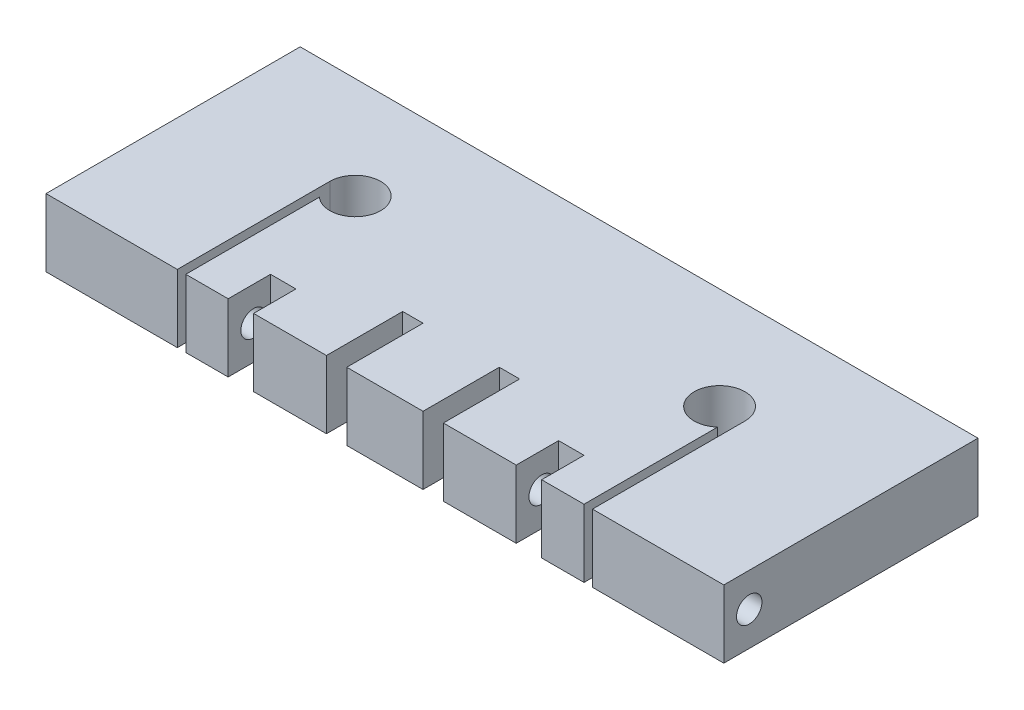
ISO-10303-21;
HEADER;
FILE_DESCRIPTION(('STEP AP214'),'2;1');
FILE_NAME('part.step','',(''),(''),'','','');
FILE_SCHEMA(('AUTOMOTIVE_DESIGN { 1 0 10303 214 1 1 1 1 }'));
ENDSEC;
DATA;
#1=APPLICATION_CONTEXT('core data for automotive mechanical design processes');
#2=APPLICATION_PROTOCOL_DEFINITION('international standard','automotive_design',2000,#1);
#3=PRODUCT_CONTEXT('',#1,'mechanical');
#4=PRODUCT('Part','Part','',(#3));
#5=PRODUCT_RELATED_PRODUCT_CATEGORY('part','',(#4));
#6=PRODUCT_DEFINITION_FORMATION('','',#4);
#7=PRODUCT_DEFINITION_CONTEXT('part definition',#1,'design');
#8=PRODUCT_DEFINITION('design','',#6,#7);
#9=PRODUCT_DEFINITION_SHAPE('','',#8);
#10=(LENGTH_UNIT() NAMED_UNIT(*) SI_UNIT(.MILLI.,.METRE.));
#11=(NAMED_UNIT(*) PLANE_ANGLE_UNIT() SI_UNIT($,.RADIAN.));
#12=(NAMED_UNIT(*) SI_UNIT($,.STERADIAN.) SOLID_ANGLE_UNIT());
#13=UNCERTAINTY_MEASURE_WITH_UNIT(LENGTH_MEASURE(1.E-05),#10,'distance_accuracy_value','');
#14=(GEOMETRIC_REPRESENTATION_CONTEXT(3) GLOBAL_UNCERTAINTY_ASSIGNED_CONTEXT((#13)) GLOBAL_UNIT_ASSIGNED_CONTEXT((#10,
#11,#12)) REPRESENTATION_CONTEXT('',''));
#15=CARTESIAN_POINT('',(0.,0.,0.));
#16=DIRECTION('',(0.,0.,1.));
#17=DIRECTION('',(1.,0.,0.));
#18=AXIS2_PLACEMENT_3D('',#15,#16,#17);
#19=CARTESIAN_POINT('',(-40.,8.,15.));
#20=DIRECTION('',(0.,0.,-1.));
#21=DIRECTION('',(-1.,0.,0.));
#22=AXIS2_PLACEMENT_3D('',#19,#20,#21);
#23=PLANE('',#22);
#24=DIRECTION('',(1.,0.,0.));
#25=VECTOR('',#24,1.);
#26=CARTESIAN_POINT('',(-40.,0.,15.));
#27=LINE('',#26,#25);
#28=CARTESIAN_POINT('',(-23.5,0.,15.));
#29=VERTEX_POINT('',#28);
#30=CARTESIAN_POINT('',(-18.5,0.,15.));
#31=VERTEX_POINT('',#30);
#32=EDGE_CURVE('E494',#29,#31,#27,.T.);
#33=ORIENTED_EDGE('',*,*,#32,.T.);
#34=DIRECTION('',(0.,-1.,0.));
#35=VECTOR('',#34,1.);
#36=CARTESIAN_POINT('',(-18.5,8.,15.));
#37=LINE('',#36,#35);
#38=CARTESIAN_POINT('',(-18.5,8.,15.));
#39=VERTEX_POINT('',#38);
#40=EDGE_CURVE('E286',#39,#31,#37,.T.);
#41=ORIENTED_EDGE('',*,*,#40,.F.);
#42=DIRECTION('',(1.,0.,0.));
#43=VECTOR('',#42,1.);
#44=CARTESIAN_POINT('',(-40.,8.,15.));
#45=LINE('',#44,#43);
#46=CARTESIAN_POINT('',(-23.5,8.,15.));
#47=VERTEX_POINT('',#46);
#48=EDGE_CURVE('E479',#47,#39,#45,.T.);
#49=ORIENTED_EDGE('',*,*,#48,.F.);
#50=DIRECTION('',(0.,1.,0.));
#51=VECTOR('',#50,1.);
#52=CARTESIAN_POINT('',(-23.5,0.,15.));
#53=LINE('',#52,#51);
#54=EDGE_CURVE('E453',#29,#47,#53,.T.);
#55=ORIENTED_EDGE('',*,*,#54,.F.);
#56=EDGE_LOOP('',(#33,#41,#49,#55));
#57=FACE_BOUND('',#56,.T.);
#58=ADVANCED_FACE('F41',(#57),#23,.F.);
#59=CARTESIAN_POINT('',(18.5,8.00000000000001,15.));
#60=VERTEX_POINT('',#59);
#61=CARTESIAN_POINT('',(23.5,8.,15.));
#62=VERTEX_POINT('',#61);
#63=EDGE_CURVE('E577',#60,#62,#45,.T.);
#64=ORIENTED_EDGE('',*,*,#63,.F.);
#65=DIRECTION('',(0.,1.,0.));
#66=VECTOR('',#65,1.);
#67=CARTESIAN_POINT('',(18.5,8.00000000000001,15.));
#68=LINE('',#67,#66);
#69=CARTESIAN_POINT('',(18.5,0.,15.));
#70=VERTEX_POINT('',#69);
#71=EDGE_CURVE('E277',#70,#60,#68,.T.);
#72=ORIENTED_EDGE('',*,*,#71,.F.);
#73=CARTESIAN_POINT('',(23.5,0.,15.));
#74=VERTEX_POINT('',#73);
#75=EDGE_CURVE('E495',#70,#74,#27,.T.);
#76=ORIENTED_EDGE('',*,*,#75,.T.);
#77=DIRECTION('',(0.,1.,0.));
#78=VECTOR('',#77,1.);
#79=CARTESIAN_POINT('',(23.5,0.,15.));
#80=LINE('',#79,#78);
#81=EDGE_CURVE('E415',#74,#62,#80,.T.);
#82=ORIENTED_EDGE('',*,*,#81,.T.);
#83=EDGE_LOOP('',(#64,#72,#76,#82));
#84=FACE_BOUND('',#83,.T.);
#85=ADVANCED_FACE('F535',(#84),#23,.F.);
#86=CARTESIAN_POINT('',(-8.00000000000001,4.,12.));
#87=DIRECTION('',(-1.,0.,0.));
#88=DIRECTION('',(0.,0.,1.));
#89=AXIS2_PLACEMENT_3D('',#86,#87,#88);
#90=CYLINDRICAL_SURFACE('',#89,1.5);
#91=CARTESIAN_POINT('',(-18.5,4.,12.));
#92=DIRECTION('',(-1.,0.,0.));
#93=DIRECTION('',(0.,0.,1.));
#94=AXIS2_PLACEMENT_3D('',#91,#92,#93);
#95=CIRCLE('',#94,1.5);
#96=CARTESIAN_POINT('',(-18.5,4.,13.5));
#97=VERTEX_POINT('',#96);
#98=EDGE_CURVE('E306',#97,#97,#95,.F.);
#99=ORIENTED_EDGE('',*,*,#98,.T.);
#100=EDGE_LOOP('',(#99));
#101=FACE_BOUND('',#100,.T.);
#102=CARTESIAN_POINT('',(-23.5,4.,12.));
#103=DIRECTION('',(1.,0.,0.));
#104=DIRECTION('',(0.,0.,-1.));
#105=AXIS2_PLACEMENT_3D('',#102,#103,#104);
#106=CIRCLE('',#105,1.5);
#107=CARTESIAN_POINT('',(-23.5,4.,10.5));
#108=VERTEX_POINT('',#107);
#109=EDGE_CURVE('E307',#108,#108,#106,.T.);
#110=ORIENTED_EDGE('',*,*,#109,.F.);
#111=EDGE_LOOP('',(#110));
#112=FACE_BOUND('',#111,.T.);
#113=ADVANCED_FACE('F516',(#101,#112),#90,.F.);
#114=CARTESIAN_POINT('',(-4.5,8.,15.));
#115=VERTEX_POINT('',#114);
#116=CARTESIAN_POINT('',(4.50000000000001,8.,15.));
#117=VERTEX_POINT('',#116);
#118=EDGE_CURVE('E578',#115,#117,#45,.T.);
#119=ORIENTED_EDGE('',*,*,#118,.F.);
#120=DIRECTION('',(0.,1.,0.));
#121=VECTOR('',#120,1.);
#122=CARTESIAN_POINT('',(-4.5,0.,15.));
#123=LINE('',#122,#121);
#124=CARTESIAN_POINT('',(-4.5,0.,15.));
#125=VERTEX_POINT('',#124);
#126=EDGE_CURVE('E325',#125,#115,#123,.T.);
#127=ORIENTED_EDGE('',*,*,#126,.F.);
#128=CARTESIAN_POINT('',(4.50000000000001,0.,15.));
#129=VERTEX_POINT('',#128);
#130=EDGE_CURVE('E883',#125,#129,#27,.T.);
#131=ORIENTED_EDGE('',*,*,#130,.T.);
#132=DIRECTION('',(0.,1.,0.));
#133=VECTOR('',#132,1.);
#134=CARTESIAN_POINT('',(4.50000000000001,0.,15.));
#135=LINE('',#134,#133);
#136=EDGE_CURVE('E351',#129,#117,#135,.T.);
#137=ORIENTED_EDGE('',*,*,#136,.T.);
#138=EDGE_LOOP('',(#119,#127,#131,#137));
#139=FACE_BOUND('',#138,.T.);
#140=ADVANCED_FACE('F543',(#139),#23,.F.);
#141=CARTESIAN_POINT('',(-15.5,8.,15.));
#142=VERTEX_POINT('',#141);
#143=CARTESIAN_POINT('',(-6.9,8.,15.));
#144=VERTEX_POINT('',#143);
#145=EDGE_CURVE('E480',#142,#144,#45,.T.);
#146=ORIENTED_EDGE('',*,*,#145,.F.);
#147=DIRECTION('',(0.,1.,0.));
#148=VECTOR('',#147,1.);
#149=CARTESIAN_POINT('',(-15.5,8.,15.));
#150=LINE('',#149,#148);
#151=CARTESIAN_POINT('',(-15.5,0.,15.));
#152=VERTEX_POINT('',#151);
#153=EDGE_CURVE('E863',#152,#142,#150,.T.);
#154=ORIENTED_EDGE('',*,*,#153,.F.);
#155=CARTESIAN_POINT('',(-6.9,0.,15.));
#156=VERTEX_POINT('',#155);
#157=EDGE_CURVE('E252',#152,#156,#27,.T.);
#158=ORIENTED_EDGE('',*,*,#157,.T.);
#159=DIRECTION('',(0.,1.,0.));
#160=VECTOR('',#159,1.);
#161=CARTESIAN_POINT('',(-6.9,0.,15.));
#162=LINE('',#161,#160);
#163=EDGE_CURVE('E329',#156,#144,#162,.T.);
#164=ORIENTED_EDGE('',*,*,#163,.T.);
#165=EDGE_LOOP('',(#146,#154,#158,#164));
#166=FACE_BOUND('',#165,.T.);
#167=ADVANCED_FACE('F568',(#166),#23,.F.);
#168=CARTESIAN_POINT('',(6.9,0.,15.));
#169=VERTEX_POINT('',#168);
#170=CARTESIAN_POINT('',(15.5,0.,15.));
#171=VERTEX_POINT('',#170);
#172=EDGE_CURVE('E596',#169,#171,#27,.T.);
#173=ORIENTED_EDGE('',*,*,#172,.T.);
#174=DIRECTION('',(0.,-1.,0.));
#175=VECTOR('',#174,1.);
#176=CARTESIAN_POINT('',(15.5,8.,15.));
#177=LINE('',#176,#175);
#178=CARTESIAN_POINT('',(15.5,8.,15.));
#179=VERTEX_POINT('',#178);
#180=EDGE_CURVE('E268',#179,#171,#177,.T.);
#181=ORIENTED_EDGE('',*,*,#180,.F.);
#182=CARTESIAN_POINT('',(6.9,8.,15.));
#183=VERTEX_POINT('',#182);
#184=EDGE_CURVE('E580',#183,#179,#45,.T.);
#185=ORIENTED_EDGE('',*,*,#184,.F.);
#186=DIRECTION('',(0.,1.,0.));
#187=VECTOR('',#186,1.);
#188=CARTESIAN_POINT('',(6.9,0.,15.));
#189=LINE('',#188,#187);
#190=EDGE_CURVE('E359',#169,#183,#189,.T.);
#191=ORIENTED_EDGE('',*,*,#190,.F.);
#192=EDGE_LOOP('',(#173,#181,#185,#191));
#193=FACE_BOUND('',#192,.T.);
#194=ADVANCED_FACE('F561',(#193),#23,.F.);
#195=CARTESIAN_POINT('',(24.5,8.,15.));
#196=VERTEX_POINT('',#195);
#197=CARTESIAN_POINT('',(40.,8.,15.));
#198=VERTEX_POINT('',#197);
#199=EDGE_CURVE('E473',#196,#198,#45,.T.);
#200=ORIENTED_EDGE('',*,*,#199,.F.);
#201=DIRECTION('',(0.,1.,0.));
#202=VECTOR('',#201,1.);
#203=CARTESIAN_POINT('',(24.5,0.,15.));
#204=LINE('',#203,#202);
#205=CARTESIAN_POINT('',(24.5,0.,15.));
#206=VERTEX_POINT('',#205);
#207=EDGE_CURVE('E402',#206,#196,#204,.T.);
#208=ORIENTED_EDGE('',*,*,#207,.F.);
#209=CARTESIAN_POINT('',(40.,0.,15.));
#210=VERTEX_POINT('',#209);
#211=EDGE_CURVE('E490',#206,#210,#27,.T.);
#212=ORIENTED_EDGE('',*,*,#211,.T.);
#213=DIRECTION('',(0.,-1.,0.));
#214=VECTOR('',#213,1.);
#215=CARTESIAN_POINT('',(40.,8.,15.));
#216=LINE('',#215,#214);
#217=EDGE_CURVE('E478',#198,#210,#216,.T.);
#218=ORIENTED_EDGE('',*,*,#217,.F.);
#219=EDGE_LOOP('',(#200,#208,#212,#218));
#220=FACE_BOUND('',#219,.T.);
#221=ADVANCED_FACE('F551',(#220),#23,.F.);
#222=CARTESIAN_POINT('',(40.,8.,15.));
#223=DIRECTION('',(-1.,0.,0.));
#224=DIRECTION('',(0.,0.,1.));
#225=AXIS2_PLACEMENT_3D('',#222,#223,#224);
#226=PLANE('',#225);
#227=CARTESIAN_POINT('',(40.,4.,12.));
#228=DIRECTION('',(1.,0.,0.));
#229=DIRECTION('',(0.,0.,-1.));
#230=AXIS2_PLACEMENT_3D('',#227,#228,#229);
#231=CIRCLE('',#230,1.5);
#232=CARTESIAN_POINT('',(40.,4.,10.5));
#233=VERTEX_POINT('',#232);
#234=EDGE_CURVE('E849',#233,#233,#231,.T.);
#235=ORIENTED_EDGE('',*,*,#234,.F.);
#236=EDGE_LOOP('',(#235));
#237=FACE_BOUND('',#236,.T.);
#238=DIRECTION('',(0.,0.,-1.));
#239=VECTOR('',#238,1.);
#240=CARTESIAN_POINT('',(40.,0.,15.));
#241=LINE('',#240,#239);
#242=CARTESIAN_POINT('',(40.,0.,-15.));
#243=VERTEX_POINT('',#242);
#244=EDGE_CURVE('E419',#210,#243,#241,.T.);
#245=ORIENTED_EDGE('',*,*,#244,.T.);
#246=DIRECTION('',(0.,-1.,0.));
#247=VECTOR('',#246,1.);
#248=CARTESIAN_POINT('',(40.,8.,-15.));
#249=LINE('',#248,#247);
#250=CARTESIAN_POINT('',(40.,8.,-15.));
#251=VERTEX_POINT('',#250);
#252=EDGE_CURVE('E11',#251,#243,#249,.T.);
#253=ORIENTED_EDGE('',*,*,#252,.F.);
#254=DIRECTION('',(0.,0.,-1.));
#255=VECTOR('',#254,1.);
#256=CARTESIAN_POINT('',(40.,8.,15.));
#257=LINE('',#256,#255);
#258=EDGE_CURVE('E462',#198,#251,#257,.T.);
#259=ORIENTED_EDGE('',*,*,#258,.F.);
#260=ORIENTED_EDGE('',*,*,#217,.T.);
#261=EDGE_LOOP('',(#245,#253,#259,#260));
#262=FACE_BOUND('',#261,.T.);
#263=ADVANCED_FACE('F43',(#237,#262),#226,.F.);
#264=CARTESIAN_POINT('',(-40.,8.,-15.));
#265=DIRECTION('',(0.,0.,1.));
#266=DIRECTION('',(1.,0.,0.));
#267=AXIS2_PLACEMENT_3D('',#264,#265,#266);
#268=PLANE('',#267);
#269=DIRECTION('',(-1.,0.,0.));
#270=VECTOR('',#269,1.);
#271=CARTESIAN_POINT('',(-40.,0.,-15.));
#272=LINE('',#271,#270);
#273=CARTESIAN_POINT('',(-40.,0.,-15.));
#274=VERTEX_POINT('',#273);
#275=EDGE_CURVE('E484',#243,#274,#272,.T.);
#276=ORIENTED_EDGE('',*,*,#275,.T.);
#277=DIRECTION('',(0.,-1.,0.));
#278=VECTOR('',#277,1.);
#279=CARTESIAN_POINT('',(-40.,8.,-15.));
#280=LINE('',#279,#278);
#281=CARTESIAN_POINT('',(-40.,8.,-15.));
#282=VERTEX_POINT('',#281);
#283=EDGE_CURVE('E51',#282,#274,#280,.T.);
#284=ORIENTED_EDGE('',*,*,#283,.F.);
#285=DIRECTION('',(-1.,0.,0.));
#286=VECTOR('',#285,1.);
#287=CARTESIAN_POINT('',(-40.,8.,-15.));
#288=LINE('',#287,#286);
#289=EDGE_CURVE('E466',#251,#282,#288,.T.);
#290=ORIENTED_EDGE('',*,*,#289,.F.);
#291=ORIENTED_EDGE('',*,*,#252,.T.);
#292=EDGE_LOOP('',(#276,#284,#290,#291));
#293=FACE_BOUND('',#292,.T.);
#294=ADVANCED_FACE('F558',(#293),#268,.F.);
#295=CARTESIAN_POINT('',(-40.,8.,15.));
#296=DIRECTION('',(1.,0.,0.));
#297=DIRECTION('',(0.,0.,-1.));
#298=AXIS2_PLACEMENT_3D('',#295,#296,#297);
#299=PLANE('',#298);
#300=CARTESIAN_POINT('',(-40.,4.,12.));
#301=DIRECTION('',(-1.,0.,0.));
#302=DIRECTION('',(0.,0.,1.));
#303=AXIS2_PLACEMENT_3D('',#300,#301,#302);
#304=CIRCLE('',#303,1.5);
#305=CARTESIAN_POINT('',(-40.,4.,13.5));
#306=VERTEX_POINT('',#305);
#307=EDGE_CURVE('E302',#306,#306,#304,.T.);
#308=ORIENTED_EDGE('',*,*,#307,.F.);
#309=EDGE_LOOP('',(#308));
#310=FACE_BOUND('',#309,.T.);
#311=DIRECTION('',(0.,0.,1.));
#312=VECTOR('',#311,1.);
#313=CARTESIAN_POINT('',(-40.,0.,15.));
#314=LINE('',#313,#312);
#315=CARTESIAN_POINT('',(-40.,0.,15.));
#316=VERTEX_POINT('',#315);
#317=EDGE_CURVE('E487',#274,#316,#314,.T.);
#318=ORIENTED_EDGE('',*,*,#317,.T.);
#319=DIRECTION('',(0.,-1.,0.));
#320=VECTOR('',#319,1.);
#321=CARTESIAN_POINT('',(-40.,8.,15.));
#322=LINE('',#321,#320);
#323=CARTESIAN_POINT('',(-40.,8.,15.));
#324=VERTEX_POINT('',#323);
#325=EDGE_CURVE('E499',#324,#316,#322,.T.);
#326=ORIENTED_EDGE('',*,*,#325,.F.);
#327=DIRECTION('',(0.,0.,1.));
#328=VECTOR('',#327,1.);
#329=CARTESIAN_POINT('',(-40.,8.,15.));
#330=LINE('',#329,#328);
#331=EDGE_CURVE('E470',#282,#324,#330,.T.);
#332=ORIENTED_EDGE('',*,*,#331,.F.);
#333=ORIENTED_EDGE('',*,*,#283,.T.);
#334=EDGE_LOOP('',(#318,#326,#332,#333));
#335=FACE_BOUND('',#334,.T.);
#336=ADVANCED_FACE('F549',(#310,#335),#299,.F.);
#337=CARTESIAN_POINT('',(-24.5,0.,15.));
#338=VERTEX_POINT('',#337);
#339=EDGE_CURVE('E467',#316,#338,#27,.T.);
#340=ORIENTED_EDGE('',*,*,#339,.T.);
#341=DIRECTION('',(0.,1.,0.));
#342=VECTOR('',#341,1.);
#343=CARTESIAN_POINT('',(-24.5,0.,15.));
#344=LINE('',#343,#342);
#345=CARTESIAN_POINT('',(-24.5,8.,15.));
#346=VERTEX_POINT('',#345);
#347=EDGE_CURVE('E456',#338,#346,#344,.T.);
#348=ORIENTED_EDGE('',*,*,#347,.T.);
#349=EDGE_CURVE('E474',#324,#346,#45,.T.);
#350=ORIENTED_EDGE('',*,*,#349,.F.);
#351=ORIENTED_EDGE('',*,*,#325,.T.);
#352=EDGE_LOOP('',(#340,#348,#350,#351));
#353=FACE_BOUND('',#352,.T.);
#354=ADVANCED_FACE('F538',(#353),#23,.F.);
#355=CARTESIAN_POINT('',(0.,8.,0.));
#356=DIRECTION('',(0.,-1.,0.));
#357=DIRECTION('',(0.,0.,-1.));
#358=AXIS2_PLACEMENT_3D('',#355,#356,#357);
#359=PLANE('',#358);
#360=ORIENTED_EDGE('',*,*,#48,.T.);
#361=DIRECTION('',(0.,0.,1.));
#362=VECTOR('',#361,1.);
#363=CARTESIAN_POINT('',(-18.5,8.,10.));
#364=LINE('',#363,#362);
#365=CARTESIAN_POINT('',(-18.5,8.,10.));
#366=VERTEX_POINT('',#365);
#367=EDGE_CURVE('E258',#366,#39,#364,.T.);
#368=ORIENTED_EDGE('',*,*,#367,.F.);
#369=DIRECTION('',(-1.,0.,0.));
#370=VECTOR('',#369,1.);
#371=CARTESIAN_POINT('',(-18.5,8.,10.));
#372=LINE('',#371,#370);
#373=CARTESIAN_POINT('',(-15.5,8.,10.));
#374=VERTEX_POINT('',#373);
#375=EDGE_CURVE('E240',#374,#366,#372,.T.);
#376=ORIENTED_EDGE('',*,*,#375,.F.);
#377=DIRECTION('',(0.,0.,1.));
#378=VECTOR('',#377,1.);
#379=CARTESIAN_POINT('',(-15.5,8.,10.));
#380=LINE('',#379,#378);
#381=EDGE_CURVE('E237',#374,#142,#380,.T.);
#382=ORIENTED_EDGE('',*,*,#381,.T.);
#383=ORIENTED_EDGE('',*,*,#145,.T.);
#384=DIRECTION('',(0.,0.,-1.));
#385=VECTOR('',#384,1.);
#386=CARTESIAN_POINT('',(-6.9,8.,0.));
#387=LINE('',#386,#385);
#388=CARTESIAN_POINT('',(-6.9,8.,6.));
#389=VERTEX_POINT('',#388);
#390=EDGE_CURVE('E380',#144,#389,#387,.T.);
#391=ORIENTED_EDGE('',*,*,#390,.T.);
#392=DIRECTION('',(1.,0.,0.));
#393=VECTOR('',#392,1.);
#394=CARTESIAN_POINT('',(0.,8.,6.));
#395=LINE('',#394,#393);
#396=CARTESIAN_POINT('',(-4.49999999999999,8.,6.));
#397=VERTEX_POINT('',#396);
#398=EDGE_CURVE('E376',#389,#397,#395,.T.);
#399=ORIENTED_EDGE('',*,*,#398,.T.);
#400=DIRECTION('',(0.,0.,1.));
#401=VECTOR('',#400,1.);
#402=CARTESIAN_POINT('',(-4.49999999999999,8.,0.));
#403=LINE('',#402,#401);
#404=EDGE_CURVE('E384',#397,#115,#403,.T.);
#405=ORIENTED_EDGE('',*,*,#404,.T.);
#406=ORIENTED_EDGE('',*,*,#118,.T.);
#407=DIRECTION('',(0.,0.,-1.));
#408=VECTOR('',#407,1.);
#409=CARTESIAN_POINT('',(4.5,8.,0.));
#410=LINE('',#409,#408);
#411=CARTESIAN_POINT('',(4.5,8.,6.));
#412=VERTEX_POINT('',#411);
#413=EDGE_CURVE('E372',#117,#412,#410,.T.);
#414=ORIENTED_EDGE('',*,*,#413,.T.);
#415=DIRECTION('',(1.,0.,0.));
#416=VECTOR('',#415,1.);
#417=CARTESIAN_POINT('',(0.,8.,6.));
#418=LINE('',#417,#416);
#419=CARTESIAN_POINT('',(6.9,8.,6.));
#420=VERTEX_POINT('',#419);
#421=EDGE_CURVE('E368',#412,#420,#418,.T.);
#422=ORIENTED_EDGE('',*,*,#421,.T.);
#423=DIRECTION('',(0.,0.,1.));
#424=VECTOR('',#423,1.);
#425=CARTESIAN_POINT('',(6.9,8.,0.));
#426=LINE('',#425,#424);
#427=EDGE_CURVE('E328',#420,#183,#426,.T.);
#428=ORIENTED_EDGE('',*,*,#427,.T.);
#429=ORIENTED_EDGE('',*,*,#184,.T.);
#430=DIRECTION('',(0.,0.,1.));
#431=VECTOR('',#430,1.);
#432=CARTESIAN_POINT('',(15.5,8.,10.));
#433=LINE('',#432,#431);
#434=CARTESIAN_POINT('',(15.5,8.,10.));
#435=VERTEX_POINT('',#434);
#436=EDGE_CURVE('E291',#435,#179,#433,.T.);
#437=ORIENTED_EDGE('',*,*,#436,.F.);
#438=DIRECTION('',(-1.,0.,0.));
#439=VECTOR('',#438,1.);
#440=CARTESIAN_POINT('',(18.5,8.00000000000001,10.));
#441=LINE('',#440,#439);
#442=CARTESIAN_POINT('',(18.5,8.00000000000001,10.));
#443=VERTEX_POINT('',#442);
#444=EDGE_CURVE('E267',#443,#435,#441,.T.);
#445=ORIENTED_EDGE('',*,*,#444,.F.);
#446=DIRECTION('',(0.,0.,1.));
#447=VECTOR('',#446,1.);
#448=CARTESIAN_POINT('',(18.5,8.00000000000001,10.));
#449=LINE('',#448,#447);
#450=EDGE_CURVE('E276',#443,#60,#449,.T.);
#451=ORIENTED_EDGE('',*,*,#450,.T.);
#452=ORIENTED_EDGE('',*,*,#63,.T.);
#453=DIRECTION('',(0.,0.,1.));
#454=VECTOR('',#453,1.);
#455=CARTESIAN_POINT('',(23.5,8.,15.));
#456=LINE('',#455,#454);
#457=CARTESIAN_POINT('',(23.5,8.,-0.763932022500208));
#458=VERTEX_POINT('',#457);
#459=EDGE_CURVE('E394',#458,#62,#456,.T.);
#460=ORIENTED_EDGE('',*,*,#459,.F.);
#461=CARTESIAN_POINT('',(21.5,8.,-3.));
#462=DIRECTION('',(0.,1.,0.));
#463=DIRECTION('',(0.,0.,-1.));
#464=AXIS2_PLACEMENT_3D('',#461,#462,#463);
#465=CIRCLE('',#464,3.);
#466=CARTESIAN_POINT('',(24.5,8.,-3.));
#467=VERTEX_POINT('',#466);
#468=EDGE_CURVE('E407',#467,#458,#465,.T.);
#469=ORIENTED_EDGE('',*,*,#468,.F.);
#470=DIRECTION('',(0.,0.,-1.));
#471=VECTOR('',#470,1.);
#472=CARTESIAN_POINT('',(24.5,8.,-3.));
#473=LINE('',#472,#471);
#474=EDGE_CURVE('E403',#196,#467,#473,.T.);
#475=ORIENTED_EDGE('',*,*,#474,.F.);
#476=ORIENTED_EDGE('',*,*,#199,.T.);
#477=ORIENTED_EDGE('',*,*,#258,.T.);
#478=ORIENTED_EDGE('',*,*,#289,.T.);
#479=ORIENTED_EDGE('',*,*,#331,.T.);
#480=ORIENTED_EDGE('',*,*,#349,.T.);
#481=DIRECTION('',(0.,0.,1.));
#482=VECTOR('',#481,1.);
#483=CARTESIAN_POINT('',(-24.5,8.,-2.99999999999999));
#484=LINE('',#483,#482);
#485=CARTESIAN_POINT('',(-24.5,8.,-2.99999999999999));
#486=VERTEX_POINT('',#485);
#487=EDGE_CURVE('E445',#486,#346,#484,.T.);
#488=ORIENTED_EDGE('',*,*,#487,.F.);
#489=CARTESIAN_POINT('',(-21.5,8.,-2.99999999999999));
#490=DIRECTION('',(0.,1.,0.));
#491=DIRECTION('',(0.,0.,1.));
#492=AXIS2_PLACEMENT_3D('',#489,#490,#491);
#493=CIRCLE('',#492,3.);
#494=CARTESIAN_POINT('',(-23.5,8.,-0.763932022500203));
#495=VERTEX_POINT('',#494);
#496=EDGE_CURVE('E388',#495,#486,#493,.T.);
#497=ORIENTED_EDGE('',*,*,#496,.F.);
#498=DIRECTION('',(0.,0.,-1.));
#499=VECTOR('',#498,1.);
#500=CARTESIAN_POINT('',(-23.5,8.,15.));
#501=LINE('',#500,#499);
#502=EDGE_CURVE('E433',#47,#495,#501,.T.);
#503=ORIENTED_EDGE('',*,*,#502,.F.);
#504=EDGE_LOOP('',(#360,#368,#376,#382,#383,#391,#399,#405,#406,#414,#422,#428,#429,#437,#445,
#451,#452,#460,#469,#475,#476,#477,#478,#479,#480,#488,#497,#503));
#505=FACE_BOUND('',#504,.T.);
#506=ADVANCED_FACE('F548',(#505),#359,.F.);
#507=CARTESIAN_POINT('',(0.,0.,0.));
#508=DIRECTION('',(0.,-1.,0.));
#509=DIRECTION('',(0.,0.,-1.));
#510=AXIS2_PLACEMENT_3D('',#507,#508,#509);
#511=PLANE('',#510);
#512=DIRECTION('',(0.,0.,1.));
#513=VECTOR('',#512,1.);
#514=CARTESIAN_POINT('',(-18.5,0.,10.));
#515=LINE('',#514,#513);
#516=CARTESIAN_POINT('',(-18.5,0.,10.));
#517=VERTEX_POINT('',#516);
#518=EDGE_CURVE('E254',#517,#31,#515,.T.);
#519=ORIENTED_EDGE('',*,*,#518,.T.);
#520=ORIENTED_EDGE('',*,*,#32,.F.);
#521=DIRECTION('',(0.,0.,-1.));
#522=VECTOR('',#521,1.);
#523=CARTESIAN_POINT('',(-23.5,0.,15.));
#524=LINE('',#523,#522);
#525=CARTESIAN_POINT('',(-23.5,0.,-0.763932022500203));
#526=VERTEX_POINT('',#525);
#527=EDGE_CURVE('E437',#29,#526,#524,.T.);
#528=ORIENTED_EDGE('',*,*,#527,.T.);
#529=CARTESIAN_POINT('',(-21.5,0.,-2.99999999999999));
#530=DIRECTION('',(0.,1.,0.));
#531=DIRECTION('',(0.,0.,1.));
#532=AXIS2_PLACEMENT_3D('',#529,#530,#531);
#533=CIRCLE('',#532,3.);
#534=CARTESIAN_POINT('',(-24.5,0.,-2.99999999999999));
#535=VERTEX_POINT('',#534);
#536=EDGE_CURVE('E428',#526,#535,#533,.T.);
#537=ORIENTED_EDGE('',*,*,#536,.T.);
#538=DIRECTION('',(0.,0.,1.));
#539=VECTOR('',#538,1.);
#540=CARTESIAN_POINT('',(-24.5,0.,-2.99999999999999));
#541=LINE('',#540,#539);
#542=EDGE_CURVE('E432',#535,#338,#541,.T.);
#543=ORIENTED_EDGE('',*,*,#542,.T.);
#544=ORIENTED_EDGE('',*,*,#339,.F.);
#545=ORIENTED_EDGE('',*,*,#317,.F.);
#546=ORIENTED_EDGE('',*,*,#275,.F.);
#547=ORIENTED_EDGE('',*,*,#244,.F.);
#548=ORIENTED_EDGE('',*,*,#211,.F.);
#549=DIRECTION('',(0.,0.,-1.));
#550=VECTOR('',#549,1.);
#551=CARTESIAN_POINT('',(24.5,0.,-3.));
#552=LINE('',#551,#550);
#553=CARTESIAN_POINT('',(24.5,0.,-3.));
#554=VERTEX_POINT('',#553);
#555=EDGE_CURVE('E389',#206,#554,#552,.T.);
#556=ORIENTED_EDGE('',*,*,#555,.T.);
#557=CARTESIAN_POINT('',(21.5,0.,-3.));
#558=DIRECTION('',(0.,1.,0.));
#559=DIRECTION('',(0.,0.,-1.));
#560=AXIS2_PLACEMENT_3D('',#557,#558,#559);
#561=CIRCLE('',#560,3.);
#562=CARTESIAN_POINT('',(23.5,0.,-0.763932022500208));
#563=VERTEX_POINT('',#562);
#564=EDGE_CURVE('E393',#554,#563,#561,.T.);
#565=ORIENTED_EDGE('',*,*,#564,.T.);
#566=DIRECTION('',(0.,0.,1.));
#567=VECTOR('',#566,1.);
#568=CARTESIAN_POINT('',(23.5,0.,15.));
#569=LINE('',#568,#567);
#570=EDGE_CURVE('E398',#563,#74,#569,.T.);
#571=ORIENTED_EDGE('',*,*,#570,.T.);
#572=ORIENTED_EDGE('',*,*,#75,.F.);
#573=DIRECTION('',(0.,0.,1.));
#574=VECTOR('',#573,1.);
#575=CARTESIAN_POINT('',(18.5,0.,10.));
#576=LINE('',#575,#574);
#577=CARTESIAN_POINT('',(18.5,0.,10.));
#578=VERTEX_POINT('',#577);
#579=EDGE_CURVE('E283',#578,#70,#576,.T.);
#580=ORIENTED_EDGE('',*,*,#579,.F.);
#581=DIRECTION('',(1.,0.,0.));
#582=VECTOR('',#581,1.);
#583=CARTESIAN_POINT('',(18.5,0.,10.));
#584=LINE('',#583,#582);
#585=CARTESIAN_POINT('',(15.5,0.,10.));
#586=VERTEX_POINT('',#585);
#587=EDGE_CURVE('E273',#586,#578,#584,.T.);
#588=ORIENTED_EDGE('',*,*,#587,.F.);
#589=DIRECTION('',(0.,0.,1.));
#590=VECTOR('',#589,1.);
#591=CARTESIAN_POINT('',(15.5,0.,10.));
#592=LINE('',#591,#590);
#593=EDGE_CURVE('E287',#586,#171,#592,.T.);
#594=ORIENTED_EDGE('',*,*,#593,.T.);
#595=ORIENTED_EDGE('',*,*,#172,.F.);
#596=DIRECTION('',(0.,0.,-1.));
#597=VECTOR('',#596,1.);
#598=CARTESIAN_POINT('',(6.9,0.,15.));
#599=LINE('',#598,#597);
#600=CARTESIAN_POINT('',(6.9,0.,6.));
#601=VERTEX_POINT('',#600);
#602=EDGE_CURVE('E343',#169,#601,#599,.T.);
#603=ORIENTED_EDGE('',*,*,#602,.T.);
#604=DIRECTION('',(-1.,0.,0.));
#605=VECTOR('',#604,1.);
#606=CARTESIAN_POINT('',(4.5,0.,6.));
#607=LINE('',#606,#605);
#608=CARTESIAN_POINT('',(4.5,0.,6.));
#609=VERTEX_POINT('',#608);
#610=EDGE_CURVE('E347',#601,#609,#607,.T.);
#611=ORIENTED_EDGE('',*,*,#610,.T.);
#612=DIRECTION('',(0.,0.,1.));
#613=VECTOR('',#612,1.);
#614=CARTESIAN_POINT('',(4.50000000000001,0.,15.));
#615=LINE('',#614,#613);
#616=EDGE_CURVE('E311',#609,#129,#615,.T.);
#617=ORIENTED_EDGE('',*,*,#616,.T.);
#618=ORIENTED_EDGE('',*,*,#130,.F.);
#619=DIRECTION('',(0.,0.,-1.));
#620=VECTOR('',#619,1.);
#621=CARTESIAN_POINT('',(-4.5,0.,15.));
#622=LINE('',#621,#620);
#623=CARTESIAN_POINT('',(-4.49999999999999,0.,6.));
#624=VERTEX_POINT('',#623);
#625=EDGE_CURVE('E312',#125,#624,#622,.T.);
#626=ORIENTED_EDGE('',*,*,#625,.T.);
#627=DIRECTION('',(-1.,0.,0.));
#628=VECTOR('',#627,1.);
#629=CARTESIAN_POINT('',(-4.49999999999999,0.,6.));
#630=LINE('',#629,#628);
#631=CARTESIAN_POINT('',(-6.9,0.,6.));
#632=VERTEX_POINT('',#631);
#633=EDGE_CURVE('E316',#624,#632,#630,.T.);
#634=ORIENTED_EDGE('',*,*,#633,.T.);
#635=DIRECTION('',(0.,0.,1.));
#636=VECTOR('',#635,1.);
#637=CARTESIAN_POINT('',(-6.9,0.,15.));
#638=LINE('',#637,#636);
#639=EDGE_CURVE('E321',#632,#156,#638,.T.);
#640=ORIENTED_EDGE('',*,*,#639,.T.);
#641=ORIENTED_EDGE('',*,*,#157,.F.);
#642=DIRECTION('',(0.,0.,1.));
#643=VECTOR('',#642,1.);
#644=CARTESIAN_POINT('',(-15.5,0.,10.));
#645=LINE('',#644,#643);
#646=CARTESIAN_POINT('',(-15.5,0.,10.));
#647=VERTEX_POINT('',#646);
#648=EDGE_CURVE('E234',#647,#152,#645,.T.);
#649=ORIENTED_EDGE('',*,*,#648,.F.);
#650=DIRECTION('',(1.,0.,0.));
#651=VECTOR('',#650,1.);
#652=CARTESIAN_POINT('',(-18.5,0.,10.));
#653=LINE('',#652,#651);
#654=EDGE_CURVE('E241',#517,#647,#653,.T.);
#655=ORIENTED_EDGE('',*,*,#654,.F.);
#656=EDGE_LOOP('',(#519,#520,#528,#537,#543,#544,#545,#546,#547,#548,#556,#565,#571,#572,#580,
#588,#594,#595,#603,#611,#617,#618,#626,#634,#640,#641,#649,#655));
#657=FACE_BOUND('',#656,.T.);
#658=ADVANCED_FACE('F250',(#657),#511,.T.);
#659=CARTESIAN_POINT('',(-21.5,0.,-2.99999999999999));
#660=DIRECTION('',(0.,1.,0.));
#661=DIRECTION('',(0.,0.,1.));
#662=AXIS2_PLACEMENT_3D('',#659,#660,#661);
#663=CYLINDRICAL_SURFACE('',#662,3.);
#664=ORIENTED_EDGE('',*,*,#496,.T.);
#665=DIRECTION('',(0.,1.,0.));
#666=VECTOR('',#665,1.);
#667=CARTESIAN_POINT('',(-24.5,0.,-2.99999999999999));
#668=LINE('',#667,#666);
#669=EDGE_CURVE('E441',#535,#486,#668,.T.);
#670=ORIENTED_EDGE('',*,*,#669,.F.);
#671=ORIENTED_EDGE('',*,*,#536,.F.);
#672=DIRECTION('',(0.,1.,0.));
#673=VECTOR('',#672,1.);
#674=CARTESIAN_POINT('',(-23.5,0.,-0.763932022500203));
#675=LINE('',#674,#673);
#676=EDGE_CURVE('E408',#526,#495,#675,.T.);
#677=ORIENTED_EDGE('',*,*,#676,.T.);
#678=EDGE_LOOP('',(#664,#670,#671,#677));
#679=FACE_BOUND('',#678,.T.);
#680=ADVANCED_FACE('F636',(#679),#663,.F.);
#681=CARTESIAN_POINT('',(-23.5,0.,15.));
#682=DIRECTION('',(1.,0.,0.));
#683=DIRECTION('',(0.,0.,-1.));
#684=AXIS2_PLACEMENT_3D('',#681,#682,#683);
#685=PLANE('',#684);
#686=ORIENTED_EDGE('',*,*,#109,.T.);
#687=EDGE_LOOP('',(#686));
#688=FACE_BOUND('',#687,.T.);
#689=ORIENTED_EDGE('',*,*,#502,.T.);
#690=ORIENTED_EDGE('',*,*,#676,.F.);
#691=ORIENTED_EDGE('',*,*,#527,.F.);
#692=ORIENTED_EDGE('',*,*,#54,.T.);
#693=EDGE_LOOP('',(#689,#690,#691,#692));
#694=FACE_BOUND('',#693,.T.);
#695=ADVANCED_FACE('F632',(#688,#694),#685,.F.);
#696=CARTESIAN_POINT('',(-24.5,0.,-2.99999999999999));
#697=DIRECTION('',(-1.,0.,0.));
#698=DIRECTION('',(0.,0.,1.));
#699=AXIS2_PLACEMENT_3D('',#696,#697,#698);
#700=PLANE('',#699);
#701=CARTESIAN_POINT('',(-24.5,4.,12.));
#702=DIRECTION('',(-1.,0.,0.));
#703=DIRECTION('',(0.,0.,1.));
#704=AXIS2_PLACEMENT_3D('',#701,#702,#703);
#705=CIRCLE('',#704,1.5);
#706=CARTESIAN_POINT('',(-24.5,4.,13.5));
#707=VERTEX_POINT('',#706);
#708=EDGE_CURVE('E301',#707,#707,#705,.T.);
#709=ORIENTED_EDGE('',*,*,#708,.T.);
#710=EDGE_LOOP('',(#709));
#711=FACE_BOUND('',#710,.T.);
#712=ORIENTED_EDGE('',*,*,#487,.T.);
#713=ORIENTED_EDGE('',*,*,#347,.F.);
#714=ORIENTED_EDGE('',*,*,#542,.F.);
#715=ORIENTED_EDGE('',*,*,#669,.T.);
#716=EDGE_LOOP('',(#712,#713,#714,#715));
#717=FACE_BOUND('',#716,.T.);
#718=ADVANCED_FACE('F635',(#711,#717),#700,.F.);
#719=CARTESIAN_POINT('',(23.5,0.,15.));
#720=DIRECTION('',(-1.,0.,0.));
#721=DIRECTION('',(0.,0.,1.));
#722=AXIS2_PLACEMENT_3D('',#719,#720,#721);
#723=PLANE('',#722);
#724=CARTESIAN_POINT('',(23.5,4.,12.));
#725=DIRECTION('',(-1.,0.,0.));
#726=DIRECTION('',(0.,0.,1.));
#727=AXIS2_PLACEMENT_3D('',#724,#725,#726);
#728=CIRCLE('',#727,1.5);
#729=CARTESIAN_POINT('',(23.5,4.,13.5));
#730=VERTEX_POINT('',#729);
#731=EDGE_CURVE('E280',#730,#730,#728,.T.);
#732=ORIENTED_EDGE('',*,*,#731,.T.);
#733=EDGE_LOOP('',(#732));
#734=FACE_BOUND('',#733,.T.);
#735=ORIENTED_EDGE('',*,*,#459,.T.);
#736=ORIENTED_EDGE('',*,*,#81,.F.);
#737=ORIENTED_EDGE('',*,*,#570,.F.);
#738=DIRECTION('',(0.,1.,0.));
#739=VECTOR('',#738,1.);
#740=CARTESIAN_POINT('',(23.5,0.,-0.763932022500208));
#741=LINE('',#740,#739);
#742=EDGE_CURVE('E420',#563,#458,#741,.T.);
#743=ORIENTED_EDGE('',*,*,#742,.T.);
#744=EDGE_LOOP('',(#735,#736,#737,#743));
#745=FACE_BOUND('',#744,.T.);
#746=ADVANCED_FACE('F610',(#734,#745),#723,.F.);
#747=CARTESIAN_POINT('',(21.5,0.,-3.));
#748=DIRECTION('',(0.,1.,0.));
#749=DIRECTION('',(0.,0.,1.));
#750=AXIS2_PLACEMENT_3D('',#747,#748,#749);
#751=CYLINDRICAL_SURFACE('',#750,3.);
#752=ORIENTED_EDGE('',*,*,#468,.T.);
#753=ORIENTED_EDGE('',*,*,#742,.F.);
#754=ORIENTED_EDGE('',*,*,#564,.F.);
#755=DIRECTION('',(0.,1.,0.));
#756=VECTOR('',#755,1.);
#757=CARTESIAN_POINT('',(24.5,0.,-3.));
#758=LINE('',#757,#756);
#759=EDGE_CURVE('E423',#554,#467,#758,.T.);
#760=ORIENTED_EDGE('',*,*,#759,.T.);
#761=EDGE_LOOP('',(#752,#753,#754,#760));
#762=FACE_BOUND('',#761,.T.);
#763=ADVANCED_FACE('F613',(#762),#751,.F.);
#764=CARTESIAN_POINT('',(24.5,0.,-3.));
#765=DIRECTION('',(1.,0.,0.));
#766=DIRECTION('',(0.,0.,-1.));
#767=AXIS2_PLACEMENT_3D('',#764,#765,#766);
#768=PLANE('',#767);
#769=CARTESIAN_POINT('',(24.5,4.,12.));
#770=DIRECTION('',(1.,0.,0.));
#771=DIRECTION('',(0.,0.,-1.));
#772=AXIS2_PLACEMENT_3D('',#769,#770,#771);
#773=CIRCLE('',#772,1.5);
#774=CARTESIAN_POINT('',(24.5,4.,10.5));
#775=VERTEX_POINT('',#774);
#776=EDGE_CURVE('E846',#775,#775,#773,.T.);
#777=ORIENTED_EDGE('',*,*,#776,.T.);
#778=EDGE_LOOP('',(#777));
#779=FACE_BOUND('',#778,.T.);
#780=ORIENTED_EDGE('',*,*,#474,.T.);
#781=ORIENTED_EDGE('',*,*,#759,.F.);
#782=ORIENTED_EDGE('',*,*,#555,.F.);
#783=ORIENTED_EDGE('',*,*,#207,.T.);
#784=EDGE_LOOP('',(#780,#781,#782,#783));
#785=FACE_BOUND('',#784,.T.);
#786=ADVANCED_FACE('F615',(#779,#785),#768,.F.);
#787=CARTESIAN_POINT('',(4.50000000000001,0.,15.));
#788=DIRECTION('',(-1.,0.,0.));
#789=DIRECTION('',(0.,0.,1.));
#790=AXIS2_PLACEMENT_3D('',#787,#788,#789);
#791=PLANE('',#790);
#792=ORIENTED_EDGE('',*,*,#136,.F.);
#793=ORIENTED_EDGE('',*,*,#616,.F.);
#794=DIRECTION('',(0.,1.,0.));
#795=VECTOR('',#794,1.);
#796=CARTESIAN_POINT('',(4.5,0.,6.));
#797=LINE('',#796,#795);
#798=EDGE_CURVE('E317',#609,#412,#797,.T.);
#799=ORIENTED_EDGE('',*,*,#798,.T.);
#800=ORIENTED_EDGE('',*,*,#413,.F.);
#801=EDGE_LOOP('',(#792,#793,#799,#800));
#802=FACE_BOUND('',#801,.T.);
#803=ADVANCED_FACE('F618',(#802),#791,.F.);
#804=CARTESIAN_POINT('',(4.5,0.,6.));
#805=DIRECTION('',(0.,0.,-1.));
#806=DIRECTION('',(-1.,0.,0.));
#807=AXIS2_PLACEMENT_3D('',#804,#805,#806);
#808=PLANE('',#807);
#809=ORIENTED_EDGE('',*,*,#798,.F.);
#810=ORIENTED_EDGE('',*,*,#610,.F.);
#811=DIRECTION('',(0.,1.,0.));
#812=VECTOR('',#811,1.);
#813=CARTESIAN_POINT('',(6.9,0.,6.));
#814=LINE('',#813,#812);
#815=EDGE_CURVE('E355',#601,#420,#814,.T.);
#816=ORIENTED_EDGE('',*,*,#815,.T.);
#817=ORIENTED_EDGE('',*,*,#421,.F.);
#818=EDGE_LOOP('',(#809,#810,#816,#817));
#819=FACE_BOUND('',#818,.T.);
#820=ADVANCED_FACE('F625',(#819),#808,.F.);
#821=CARTESIAN_POINT('',(6.9,0.,15.));
#822=DIRECTION('',(1.,0.,0.));
#823=DIRECTION('',(0.,0.,-1.));
#824=AXIS2_PLACEMENT_3D('',#821,#822,#823);
#825=PLANE('',#824);
#826=ORIENTED_EDGE('',*,*,#815,.F.);
#827=ORIENTED_EDGE('',*,*,#602,.F.);
#828=ORIENTED_EDGE('',*,*,#190,.T.);
#829=ORIENTED_EDGE('',*,*,#427,.F.);
#830=EDGE_LOOP('',(#826,#827,#828,#829));
#831=FACE_BOUND('',#830,.T.);
#832=ADVANCED_FACE('F700',(#831),#825,.F.);
#833=CARTESIAN_POINT('',(-4.5,0.,15.));
#834=DIRECTION('',(1.,0.,0.));
#835=DIRECTION('',(0.,0.,-1.));
#836=AXIS2_PLACEMENT_3D('',#833,#834,#835);
#837=PLANE('',#836);
#838=DIRECTION('',(0.,1.,0.));
#839=VECTOR('',#838,1.);
#840=CARTESIAN_POINT('',(-4.49999999999999,0.,6.));
#841=LINE('',#840,#839);
#842=EDGE_CURVE('E324',#624,#397,#841,.T.);
#843=ORIENTED_EDGE('',*,*,#842,.F.);
#844=ORIENTED_EDGE('',*,*,#625,.F.);
#845=ORIENTED_EDGE('',*,*,#126,.T.);
#846=ORIENTED_EDGE('',*,*,#404,.F.);
#847=EDGE_LOOP('',(#843,#844,#845,#846));
#848=FACE_BOUND('',#847,.T.);
#849=ADVANCED_FACE('F710',(#848),#837,.F.);
#850=CARTESIAN_POINT('',(-6.9,0.,15.));
#851=DIRECTION('',(-1.,0.,0.));
#852=DIRECTION('',(0.,0.,1.));
#853=AXIS2_PLACEMENT_3D('',#850,#851,#852);
#854=PLANE('',#853);
#855=ORIENTED_EDGE('',*,*,#163,.F.);
#856=ORIENTED_EDGE('',*,*,#639,.F.);
#857=DIRECTION('',(0.,1.,0.));
#858=VECTOR('',#857,1.);
#859=CARTESIAN_POINT('',(-6.9,0.,6.));
#860=LINE('',#859,#858);
#861=EDGE_CURVE('E333',#632,#389,#860,.T.);
#862=ORIENTED_EDGE('',*,*,#861,.T.);
#863=ORIENTED_EDGE('',*,*,#390,.F.);
#864=EDGE_LOOP('',(#855,#856,#862,#863));
#865=FACE_BOUND('',#864,.T.);
#866=ADVANCED_FACE('F720',(#865),#854,.F.);
#867=CARTESIAN_POINT('',(-4.49999999999999,0.,6.));
#868=DIRECTION('',(0.,0.,-1.));
#869=DIRECTION('',(-1.,0.,0.));
#870=AXIS2_PLACEMENT_3D('',#867,#868,#869);
#871=PLANE('',#870);
#872=ORIENTED_EDGE('',*,*,#861,.F.);
#873=ORIENTED_EDGE('',*,*,#633,.F.);
#874=ORIENTED_EDGE('',*,*,#842,.T.);
#875=ORIENTED_EDGE('',*,*,#398,.F.);
#876=EDGE_LOOP('',(#872,#873,#874,#875));
#877=FACE_BOUND('',#876,.T.);
#878=ADVANCED_FACE('F529',(#877),#871,.F.);
#879=ORIENTED_EDGE('',*,*,#307,.T.);
#880=EDGE_LOOP('',(#879));
#881=FACE_BOUND('',#880,.T.);
#882=ORIENTED_EDGE('',*,*,#708,.F.);
#883=EDGE_LOOP('',(#882));
#884=FACE_BOUND('',#883,.T.);
#885=ADVANCED_FACE('F521',(#881,#884),#90,.F.);
#886=CARTESIAN_POINT('',(-18.5,8.,10.));
#887=DIRECTION('',(-1.,0.,0.));
#888=DIRECTION('',(0.,0.,1.));
#889=AXIS2_PLACEMENT_3D('',#886,#887,#888);
#890=PLANE('',#889);
#891=ORIENTED_EDGE('',*,*,#40,.T.);
#892=ORIENTED_EDGE('',*,*,#518,.F.);
#893=DIRECTION('',(0.,-1.,0.));
#894=VECTOR('',#893,1.);
#895=CARTESIAN_POINT('',(-18.5,8.,10.));
#896=LINE('',#895,#894);
#897=EDGE_CURVE('E59',#366,#517,#896,.T.);
#898=ORIENTED_EDGE('',*,*,#897,.F.);
#899=ORIENTED_EDGE('',*,*,#367,.T.);
#900=EDGE_LOOP('',(#891,#892,#898,#899));
#901=FACE_BOUND('',#900,.T.);
#902=ORIENTED_EDGE('',*,*,#98,.F.);
#903=EDGE_LOOP('',(#902));
#904=FACE_BOUND('',#903,.T.);
#905=ADVANCED_FACE('F519',(#901,#904),#890,.F.);
#906=CARTESIAN_POINT('',(-15.5,8.,10.));
#907=DIRECTION('',(1.,0.,0.));
#908=DIRECTION('',(0.,0.,-1.));
#909=AXIS2_PLACEMENT_3D('',#906,#907,#908);
#910=PLANE('',#909);
#911=ORIENTED_EDGE('',*,*,#153,.T.);
#912=ORIENTED_EDGE('',*,*,#381,.F.);
#913=DIRECTION('',(0.,1.,0.));
#914=VECTOR('',#913,1.);
#915=CARTESIAN_POINT('',(-15.5,8.,10.));
#916=LINE('',#915,#914);
#917=EDGE_CURVE('E230',#647,#374,#916,.T.);
#918=ORIENTED_EDGE('',*,*,#917,.F.);
#919=ORIENTED_EDGE('',*,*,#648,.T.);
#920=EDGE_LOOP('',(#911,#912,#918,#919));
#921=FACE_BOUND('',#920,.T.);
#922=CARTESIAN_POINT('',(-15.5,4.,12.));
#923=DIRECTION('',(1.,0.,0.));
#924=DIRECTION('',(0.,0.,-1.));
#925=AXIS2_PLACEMENT_3D('',#922,#923,#924);
#926=CIRCLE('',#925,1.5);
#927=CARTESIAN_POINT('',(-15.5,4.,10.5));
#928=VERTEX_POINT('',#927);
#929=EDGE_CURVE('E509',#928,#928,#926,.F.);
#930=ORIENTED_EDGE('',*,*,#929,.F.);
#931=EDGE_LOOP('',(#930));
#932=FACE_BOUND('',#931,.T.);
#933=ADVANCED_FACE('F231',(#921,#932),#910,.F.);
#934=CARTESIAN_POINT('',(0.,0.,10.));
#935=DIRECTION('',(0.,0.,1.));
#936=DIRECTION('',(1.,0.,0.));
#937=AXIS2_PLACEMENT_3D('',#934,#935,#936);
#938=PLANE('',#937);
#939=ORIENTED_EDGE('',*,*,#897,.T.);
#940=ORIENTED_EDGE('',*,*,#654,.T.);
#941=ORIENTED_EDGE('',*,*,#917,.T.);
#942=ORIENTED_EDGE('',*,*,#375,.T.);
#943=EDGE_LOOP('',(#939,#940,#941,#942));
#944=FACE_BOUND('',#943,.T.);
#945=ADVANCED_FACE('F244',(#944),#938,.T.);
#946=CARTESIAN_POINT('',(18.5,8.00000000000001,10.));
#947=DIRECTION('',(1.,0.,0.));
#948=DIRECTION('',(0.,1.,0.));
#949=AXIS2_PLACEMENT_3D('',#946,#947,#948);
#950=PLANE('',#949);
#951=CARTESIAN_POINT('',(18.5,4.,12.));
#952=DIRECTION('',(1.,0.,0.));
#953=DIRECTION('',(0.,1.,0.));
#954=AXIS2_PLACEMENT_3D('',#951,#952,#953);
#955=CIRCLE('',#954,1.5);
#956=CARTESIAN_POINT('',(18.5,5.5,12.));
#957=VERTEX_POINT('',#956);
#958=EDGE_CURVE('E841',#957,#957,#955,.T.);
#959=ORIENTED_EDGE('',*,*,#958,.T.);
#960=EDGE_LOOP('',(#959));
#961=FACE_BOUND('',#960,.T.);
#962=ORIENTED_EDGE('',*,*,#71,.T.);
#963=ORIENTED_EDGE('',*,*,#450,.F.);
#964=DIRECTION('',(0.,1.,0.));
#965=VECTOR('',#964,1.);
#966=CARTESIAN_POINT('',(18.5,8.00000000000001,10.));
#967=LINE('',#966,#965);
#968=EDGE_CURVE('E263',#578,#443,#967,.T.);
#969=ORIENTED_EDGE('',*,*,#968,.F.);
#970=ORIENTED_EDGE('',*,*,#579,.T.);
#971=EDGE_LOOP('',(#962,#963,#969,#970));
#972=FACE_BOUND('',#971,.T.);
#973=ADVANCED_FACE('F789',(#961,#972),#950,.F.);
#974=CARTESIAN_POINT('',(15.5,8.,10.));
#975=DIRECTION('',(-1.,0.,0.));
#976=DIRECTION('',(0.,0.,1.));
#977=AXIS2_PLACEMENT_3D('',#974,#975,#976);
#978=PLANE('',#977);
#979=CARTESIAN_POINT('',(15.5,4.,12.));
#980=DIRECTION('',(-1.,0.,0.));
#981=DIRECTION('',(0.,0.,1.));
#982=AXIS2_PLACEMENT_3D('',#979,#980,#981);
#983=CIRCLE('',#982,1.5);
#984=CARTESIAN_POINT('',(15.5,4.,13.5));
#985=VERTEX_POINT('',#984);
#986=EDGE_CURVE('E45',#985,#985,#983,.T.);
#987=ORIENTED_EDGE('',*,*,#986,.T.);
#988=EDGE_LOOP('',(#987));
#989=FACE_BOUND('',#988,.T.);
#990=ORIENTED_EDGE('',*,*,#180,.T.);
#991=ORIENTED_EDGE('',*,*,#593,.F.);
#992=DIRECTION('',(0.,-1.,0.));
#993=VECTOR('',#992,1.);
#994=CARTESIAN_POINT('',(15.5,8.,10.));
#995=LINE('',#994,#993);
#996=EDGE_CURVE('E67',#435,#586,#995,.T.);
#997=ORIENTED_EDGE('',*,*,#996,.F.);
#998=ORIENTED_EDGE('',*,*,#436,.T.);
#999=EDGE_LOOP('',(#990,#991,#997,#998));
#1000=FACE_BOUND('',#999,.T.);
#1001=ADVANCED_FACE('F598',(#989,#1000),#978,.F.);
#1002=CARTESIAN_POINT('',(0.,0.,10.));
#1003=DIRECTION('',(0.,0.,-1.));
#1004=DIRECTION('',(-1.,0.,0.));
#1005=AXIS2_PLACEMENT_3D('',#1002,#1003,#1004);
#1006=PLANE('',#1005);
#1007=ORIENTED_EDGE('',*,*,#968,.T.);
#1008=ORIENTED_EDGE('',*,*,#444,.T.);
#1009=ORIENTED_EDGE('',*,*,#996,.T.);
#1010=ORIENTED_EDGE('',*,*,#587,.T.);
#1011=EDGE_LOOP('',(#1007,#1008,#1009,#1010));
#1012=FACE_BOUND('',#1011,.T.);
#1013=ADVANCED_FACE('F602',(#1012),#1006,.F.);
#1014=CARTESIAN_POINT('',(-8.00000000000001,4.,12.));
#1015=DIRECTION('',(-1.,0.,0.));
#1016=DIRECTION('',(0.,0.,1.));
#1017=AXIS2_PLACEMENT_3D('',#1014,#1015,#1016);
#1018=PLANE('',#1017);
#1019=CARTESIAN_POINT('',(-8.00000000000001,4.,12.));
#1020=DIRECTION('',(-1.,0.,0.));
#1021=DIRECTION('',(0.,0.,1.));
#1022=AXIS2_PLACEMENT_3D('',#1019,#1020,#1021);
#1023=CIRCLE('',#1022,1.5);
#1024=CARTESIAN_POINT('',(-8.00000000000001,4.,13.5));
#1025=VERTEX_POINT('',#1024);
#1026=EDGE_CURVE('E297',#1025,#1025,#1023,.T.);
#1027=ORIENTED_EDGE('',*,*,#1026,.T.);
#1028=EDGE_LOOP('',(#1027));
#1029=FACE_BOUND('',#1028,.T.);
#1030=ADVANCED_FACE('F767',(#1029),#1018,.T.);
#1031=ORIENTED_EDGE('',*,*,#929,.T.);
#1032=EDGE_LOOP('',(#1031));
#1033=FACE_BOUND('',#1032,.T.);
#1034=ORIENTED_EDGE('',*,*,#1026,.F.);
#1035=EDGE_LOOP('',(#1034));
#1036=FACE_BOUND('',#1035,.T.);
#1037=ADVANCED_FACE('F532',(#1033,#1036),#90,.F.);
#1038=CARTESIAN_POINT('',(7.99999999999999,4.,12.));
#1039=DIRECTION('',(1.,0.,0.));
#1040=DIRECTION('',(0.,0.,-1.));
#1041=AXIS2_PLACEMENT_3D('',#1038,#1039,#1040);
#1042=PLANE('',#1041);
#1043=CARTESIAN_POINT('',(7.99999999999999,4.,12.));
#1044=DIRECTION('',(1.,0.,0.));
#1045=DIRECTION('',(0.,0.,-1.));
#1046=AXIS2_PLACEMENT_3D('',#1043,#1044,#1045);
#1047=CIRCLE('',#1046,1.5);
#1048=CARTESIAN_POINT('',(7.99999999999999,4.,10.5));
#1049=VERTEX_POINT('',#1048);
#1050=EDGE_CURVE('E842',#1049,#1049,#1047,.T.);
#1051=ORIENTED_EDGE('',*,*,#1050,.T.);
#1052=EDGE_LOOP('',(#1051));
#1053=FACE_BOUND('',#1052,.T.);
#1054=ADVANCED_FACE('F766',(#1053),#1042,.T.);
#1055=CARTESIAN_POINT('',(7.99999999999999,4.,12.));
#1056=DIRECTION('',(1.,0.,0.));
#1057=DIRECTION('',(0.,0.,-1.));
#1058=AXIS2_PLACEMENT_3D('',#1055,#1056,#1057);
#1059=CYLINDRICAL_SURFACE('',#1058,1.5);
#1060=ORIENTED_EDGE('',*,*,#1050,.F.);
#1061=EDGE_LOOP('',(#1060));
#1062=FACE_BOUND('',#1061,.T.);
#1063=ORIENTED_EDGE('',*,*,#986,.F.);
#1064=EDGE_LOOP('',(#1063));
#1065=FACE_BOUND('',#1064,.T.);
#1066=ADVANCED_FACE('F944',(#1062,#1065),#1059,.F.);
#1067=ORIENTED_EDGE('',*,*,#958,.F.);
#1068=EDGE_LOOP('',(#1067));
#1069=FACE_BOUND('',#1068,.T.);
#1070=ORIENTED_EDGE('',*,*,#731,.F.);
#1071=EDGE_LOOP('',(#1070));
#1072=FACE_BOUND('',#1071,.T.);
#1073=ADVANCED_FACE('F953',(#1069,#1072),#1059,.F.);
#1074=ORIENTED_EDGE('',*,*,#234,.T.);
#1075=EDGE_LOOP('',(#1074));
#1076=FACE_BOUND('',#1075,.T.);
#1077=ORIENTED_EDGE('',*,*,#776,.F.);
#1078=EDGE_LOOP('',(#1077));
#1079=FACE_BOUND('',#1078,.T.);
#1080=ADVANCED_FACE('F956',(#1076,#1079),#1059,.F.);
#1081=CLOSED_SHELL('',(#58,#85,#113,#140,#167,#194,#221,#263,#294,#336,#354,#506,#658,#680,#695,
#718,#746,#763,#786,#803,#820,#832,#849,#866,#878,#885,#905,#933,#945,#973,#1001,#1013,#1030,
#1037,#1054,#1066,#1073,#1080));
#1082=MANIFOLD_SOLID_BREP('B2',#1081);
#1083=ADVANCED_BREP_SHAPE_REPRESENTATION('',(#18,#1082),#14);
#1084=SHAPE_DEFINITION_REPRESENTATION(#9,#1083);
ENDSEC;
END-ISO-10303-21;
